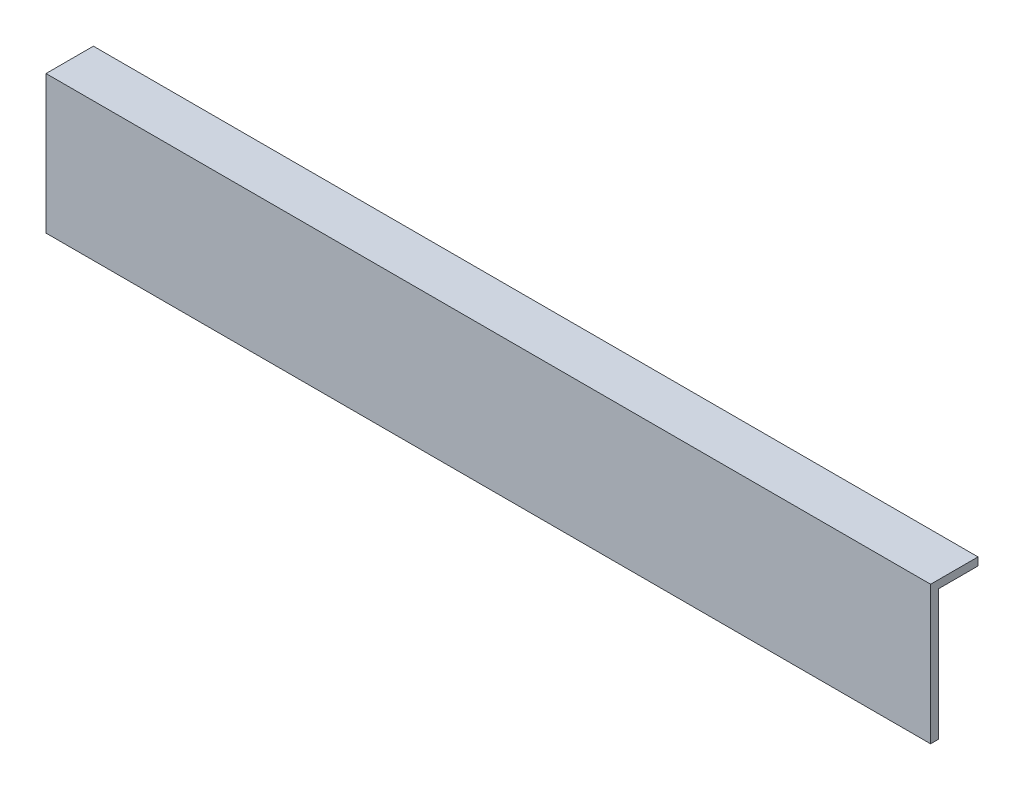
ISO-10303-21;
HEADER;
FILE_DESCRIPTION(('STEP AP214'),'2;1');
FILE_NAME('part.step','',(''),(''),'','','');
FILE_SCHEMA(('AUTOMOTIVE_DESIGN { 1 0 10303 214 1 1 1 1 }'));
ENDSEC;
DATA;
#1=APPLICATION_CONTEXT('core data for automotive mechanical design processes');
#2=APPLICATION_PROTOCOL_DEFINITION('international standard','automotive_design',2000,#1);
#3=PRODUCT_CONTEXT('',#1,'mechanical');
#4=PRODUCT('Part','Part','',(#3));
#5=PRODUCT_RELATED_PRODUCT_CATEGORY('part','',(#4));
#6=PRODUCT_DEFINITION_FORMATION('','',#4);
#7=PRODUCT_DEFINITION_CONTEXT('part definition',#1,'design');
#8=PRODUCT_DEFINITION('design','',#6,#7);
#9=PRODUCT_DEFINITION_SHAPE('','',#8);
#10=(LENGTH_UNIT() NAMED_UNIT(*) SI_UNIT(.MILLI.,.METRE.));
#11=(NAMED_UNIT(*) PLANE_ANGLE_UNIT() SI_UNIT($,.RADIAN.));
#12=(NAMED_UNIT(*) SI_UNIT($,.STERADIAN.) SOLID_ANGLE_UNIT());
#13=UNCERTAINTY_MEASURE_WITH_UNIT(LENGTH_MEASURE(1.E-05),#10,'distance_accuracy_value','');
#14=(GEOMETRIC_REPRESENTATION_CONTEXT(3) GLOBAL_UNCERTAINTY_ASSIGNED_CONTEXT((#13)) GLOBAL_UNIT_ASSIGNED_CONTEXT((#10,
#11,#12)) REPRESENTATION_CONTEXT('',''));
#15=CARTESIAN_POINT('',(0.,0.,0.));
#16=DIRECTION('',(0.,0.,1.));
#17=DIRECTION('',(1.,0.,0.));
#18=AXIS2_PLACEMENT_3D('',#15,#16,#17);
#19=CARTESIAN_POINT('',(0.,0.,-4.));
#20=DIRECTION('',(0.,0.,1.));
#21=DIRECTION('',(1.,0.,0.));
#22=AXIS2_PLACEMENT_3D('',#19,#20,#21);
#23=PLANE('',#22);
#24=DIRECTION('',(-1.,0.,0.));
#25=VECTOR('',#24,1.);
#26=CARTESIAN_POINT('',(-224.,66.0000000000001,-4.));
#27=LINE('',#26,#25);
#28=CARTESIAN_POINT('',(224.,66.0000000000001,-4.));
#29=VERTEX_POINT('',#28);
#30=CARTESIAN_POINT('',(-224.,66.0000000000001,-4.));
#31=VERTEX_POINT('',#30);
#32=EDGE_CURVE('E55',#29,#31,#27,.T.);
#33=ORIENTED_EDGE('',*,*,#32,.F.);
#34=DIRECTION('',(0.,1.,0.));
#35=VECTOR('',#34,1.);
#36=CARTESIAN_POINT('',(224.,0.,-4.));
#37=LINE('',#36,#35);
#38=CARTESIAN_POINT('',(224.,0.,-4.));
#39=VERTEX_POINT('',#38);
#40=EDGE_CURVE('E99',#39,#29,#37,.T.);
#41=ORIENTED_EDGE('',*,*,#40,.F.);
#42=DIRECTION('',(1.,0.,0.));
#43=VECTOR('',#42,1.);
#44=CARTESIAN_POINT('',(-224.,0.,-4.));
#45=LINE('',#44,#43);
#46=CARTESIAN_POINT('',(-224.,0.,-4.));
#47=VERTEX_POINT('',#46);
#48=EDGE_CURVE('E84',#47,#39,#45,.T.);
#49=ORIENTED_EDGE('',*,*,#48,.F.);
#50=DIRECTION('',(0.,-1.,0.));
#51=VECTOR('',#50,1.);
#52=CARTESIAN_POINT('',(-224.,70.0000000000001,-4.));
#53=LINE('',#52,#51);
#54=EDGE_CURVE('E101',#31,#47,#53,.T.);
#55=ORIENTED_EDGE('',*,*,#54,.F.);
#56=EDGE_LOOP('',(#33,#41,#49,#55));
#57=FACE_BOUND('',#56,.T.);
#58=ADVANCED_FACE('F38',(#57),#23,.F.);
#59=CARTESIAN_POINT('',(224.,0.,-4.));
#60=DIRECTION('',(1.,0.,0.));
#61=DIRECTION('',(0.,0.,-1.));
#62=AXIS2_PLACEMENT_3D('',#59,#60,#61);
#63=PLANE('',#62);
#64=DIRECTION('',(0.,1.,0.));
#65=VECTOR('',#64,1.);
#66=CARTESIAN_POINT('',(224.,0.,0.));
#67=LINE('',#66,#65);
#68=CARTESIAN_POINT('',(224.,0.,0.));
#69=VERTEX_POINT('',#68);
#70=CARTESIAN_POINT('',(224.,70.,0.));
#71=VERTEX_POINT('',#70);
#72=EDGE_CURVE('E86',#69,#71,#67,.T.);
#73=ORIENTED_EDGE('',*,*,#72,.F.);
#74=DIRECTION('',(0.,0.,1.));
#75=VECTOR('',#74,1.);
#76=CARTESIAN_POINT('',(224.,0.,-4.));
#77=LINE('',#76,#75);
#78=EDGE_CURVE('E11',#39,#69,#77,.T.);
#79=ORIENTED_EDGE('',*,*,#78,.F.);
#80=ORIENTED_EDGE('',*,*,#40,.T.);
#81=DIRECTION('',(0.,0.,1.));
#82=VECTOR('',#81,1.);
#83=CARTESIAN_POINT('',(224.,66.0000000000001,-24.));
#84=LINE('',#83,#82);
#85=CARTESIAN_POINT('',(224.,66.0000000000001,-24.));
#86=VERTEX_POINT('',#85);
#87=EDGE_CURVE('E93',#86,#29,#84,.T.);
#88=ORIENTED_EDGE('',*,*,#87,.F.);
#89=DIRECTION('',(0.,-1.,0.));
#90=VECTOR('',#89,1.);
#91=CARTESIAN_POINT('',(224.,70.0000000000001,-24.));
#92=LINE('',#91,#90);
#93=CARTESIAN_POINT('',(224.,70.0000000000001,-24.));
#94=VERTEX_POINT('',#93);
#95=EDGE_CURVE('E124',#94,#86,#92,.T.);
#96=ORIENTED_EDGE('',*,*,#95,.F.);
#97=DIRECTION('',(0.,0.,1.));
#98=VECTOR('',#97,1.);
#99=CARTESIAN_POINT('',(224.,70.,-4.));
#100=LINE('',#99,#98);
#101=EDGE_CURVE('E42',#94,#71,#100,.T.);
#102=ORIENTED_EDGE('',*,*,#101,.T.);
#103=EDGE_LOOP('',(#73,#79,#80,#88,#96,#102));
#104=FACE_BOUND('',#103,.T.);
#105=ADVANCED_FACE('F40',(#104),#63,.T.);
#106=CARTESIAN_POINT('',(-224.,0.,-4.));
#107=DIRECTION('',(0.,-1.,0.));
#108=DIRECTION('',(0.,0.,-1.));
#109=AXIS2_PLACEMENT_3D('',#106,#107,#108);
#110=PLANE('',#109);
#111=DIRECTION('',(1.,0.,0.));
#112=VECTOR('',#111,1.);
#113=CARTESIAN_POINT('',(-224.,0.,0.));
#114=LINE('',#113,#112);
#115=CARTESIAN_POINT('',(-224.,0.,0.));
#116=VERTEX_POINT('',#115);
#117=EDGE_CURVE('E82',#116,#69,#114,.T.);
#118=ORIENTED_EDGE('',*,*,#117,.F.);
#119=DIRECTION('',(0.,0.,1.));
#120=VECTOR('',#119,1.);
#121=CARTESIAN_POINT('',(-224.,0.,-4.));
#122=LINE('',#121,#120);
#123=EDGE_CURVE('E47',#47,#116,#122,.T.);
#124=ORIENTED_EDGE('',*,*,#123,.F.);
#125=ORIENTED_EDGE('',*,*,#48,.T.);
#126=ORIENTED_EDGE('',*,*,#78,.T.);
#127=EDGE_LOOP('',(#118,#124,#125,#126));
#128=FACE_BOUND('',#127,.T.);
#129=ADVANCED_FACE('F79',(#128),#110,.T.);
#130=CARTESIAN_POINT('',(-224.,70.0000000000001,-4.));
#131=DIRECTION('',(-1.,0.,0.));
#132=DIRECTION('',(0.,0.,1.));
#133=AXIS2_PLACEMENT_3D('',#130,#131,#132);
#134=PLANE('',#133);
#135=DIRECTION('',(0.,-1.,0.));
#136=VECTOR('',#135,1.);
#137=CARTESIAN_POINT('',(-224.,70.0000000000001,0.));
#138=LINE('',#137,#136);
#139=CARTESIAN_POINT('',(-224.,70.0000000000001,0.));
#140=VERTEX_POINT('',#139);
#141=EDGE_CURVE('E98',#140,#116,#138,.T.);
#142=ORIENTED_EDGE('',*,*,#141,.F.);
#143=DIRECTION('',(0.,0.,1.));
#144=VECTOR('',#143,1.);
#145=CARTESIAN_POINT('',(-224.,70.0000000000001,-4.));
#146=LINE('',#145,#144);
#147=CARTESIAN_POINT('',(-224.,70.0000000000001,-24.));
#148=VERTEX_POINT('',#147);
#149=EDGE_CURVE('E106',#148,#140,#146,.T.);
#150=ORIENTED_EDGE('',*,*,#149,.F.);
#151=DIRECTION('',(0.,1.,0.));
#152=VECTOR('',#151,1.);
#153=CARTESIAN_POINT('',(-224.,70.0000000000001,-24.));
#154=LINE('',#153,#152);
#155=CARTESIAN_POINT('',(-224.,66.0000000000001,-24.));
#156=VERTEX_POINT('',#155);
#157=EDGE_CURVE('E127',#156,#148,#154,.T.);
#158=ORIENTED_EDGE('',*,*,#157,.F.);
#159=DIRECTION('',(0.,0.,1.));
#160=VECTOR('',#159,1.);
#161=CARTESIAN_POINT('',(-224.,66.0000000000001,-24.));
#162=LINE('',#161,#160);
#163=EDGE_CURVE('E133',#156,#31,#162,.T.);
#164=ORIENTED_EDGE('',*,*,#163,.T.);
#165=ORIENTED_EDGE('',*,*,#54,.T.);
#166=ORIENTED_EDGE('',*,*,#123,.T.);
#167=EDGE_LOOP('',(#142,#150,#158,#164,#165,#166));
#168=FACE_BOUND('',#167,.T.);
#169=ADVANCED_FACE('F148',(#168),#134,.T.);
#170=CARTESIAN_POINT('',(224.,70.,-4.));
#171=DIRECTION('',(0.,1.,0.));
#172=DIRECTION('',(-1.,0.,0.));
#173=AXIS2_PLACEMENT_3D('',#170,#171,#172);
#174=PLANE('',#173);
#175=DIRECTION('',(-1.,0.,0.));
#176=VECTOR('',#175,1.);
#177=CARTESIAN_POINT('',(224.,70.,0.));
#178=LINE('',#177,#176);
#179=EDGE_CURVE('E92',#71,#140,#178,.T.);
#180=ORIENTED_EDGE('',*,*,#179,.F.);
#181=ORIENTED_EDGE('',*,*,#101,.F.);
#182=DIRECTION('',(1.,0.,0.));
#183=VECTOR('',#182,1.);
#184=CARTESIAN_POINT('',(-224.,70.0000000000001,-24.));
#185=LINE('',#184,#183);
#186=EDGE_CURVE('E116',#148,#94,#185,.T.);
#187=ORIENTED_EDGE('',*,*,#186,.F.);
#188=ORIENTED_EDGE('',*,*,#149,.T.);
#189=EDGE_LOOP('',(#180,#181,#187,#188));
#190=FACE_BOUND('',#189,.T.);
#191=ADVANCED_FACE('F112',(#190),#174,.T.);
#192=CARTESIAN_POINT('',(0.,0.,0.));
#193=DIRECTION('',(0.,0.,1.));
#194=DIRECTION('',(1.,0.,0.));
#195=AXIS2_PLACEMENT_3D('',#192,#193,#194);
#196=PLANE('',#195);
#197=ORIENTED_EDGE('',*,*,#72,.T.);
#198=ORIENTED_EDGE('',*,*,#179,.T.);
#199=ORIENTED_EDGE('',*,*,#141,.T.);
#200=ORIENTED_EDGE('',*,*,#117,.T.);
#201=EDGE_LOOP('',(#197,#198,#199,#200));
#202=FACE_BOUND('',#201,.T.);
#203=ADVANCED_FACE('F96',(#202),#196,.T.);
#204=CARTESIAN_POINT('',(-224.,66.0000000000001,-24.));
#205=DIRECTION('',(0.,1.,0.));
#206=DIRECTION('',(-1.,0.,0.));
#207=AXIS2_PLACEMENT_3D('',#204,#205,#206);
#208=PLANE('',#207);
#209=ORIENTED_EDGE('',*,*,#32,.T.);
#210=ORIENTED_EDGE('',*,*,#163,.F.);
#211=DIRECTION('',(-1.,0.,0.));
#212=VECTOR('',#211,1.);
#213=CARTESIAN_POINT('',(-224.,66.0000000000001,-24.));
#214=LINE('',#213,#212);
#215=EDGE_CURVE('E131',#86,#156,#214,.T.);
#216=ORIENTED_EDGE('',*,*,#215,.F.);
#217=ORIENTED_EDGE('',*,*,#87,.T.);
#218=EDGE_LOOP('',(#209,#210,#216,#217));
#219=FACE_BOUND('',#218,.T.);
#220=ADVANCED_FACE('F141',(#219),#208,.F.);
#221=CARTESIAN_POINT('',(0.,0.,-24.));
#222=DIRECTION('',(0.,0.,1.));
#223=DIRECTION('',(1.,0.,0.));
#224=AXIS2_PLACEMENT_3D('',#221,#222,#223);
#225=PLANE('',#224);
#226=ORIENTED_EDGE('',*,*,#157,.T.);
#227=ORIENTED_EDGE('',*,*,#186,.T.);
#228=ORIENTED_EDGE('',*,*,#95,.T.);
#229=ORIENTED_EDGE('',*,*,#215,.T.);
#230=EDGE_LOOP('',(#226,#227,#228,#229));
#231=FACE_BOUND('',#230,.T.);
#232=ADVANCED_FACE('F122',(#231),#225,.F.);
#233=CLOSED_SHELL('',(#58,#105,#129,#169,#191,#203,#220,#232));
#234=MANIFOLD_SOLID_BREP('B2',#233);
#235=ADVANCED_BREP_SHAPE_REPRESENTATION('',(#18,#234),#14);
#236=SHAPE_DEFINITION_REPRESENTATION(#9,#235);
ENDSEC;
END-ISO-10303-21;
